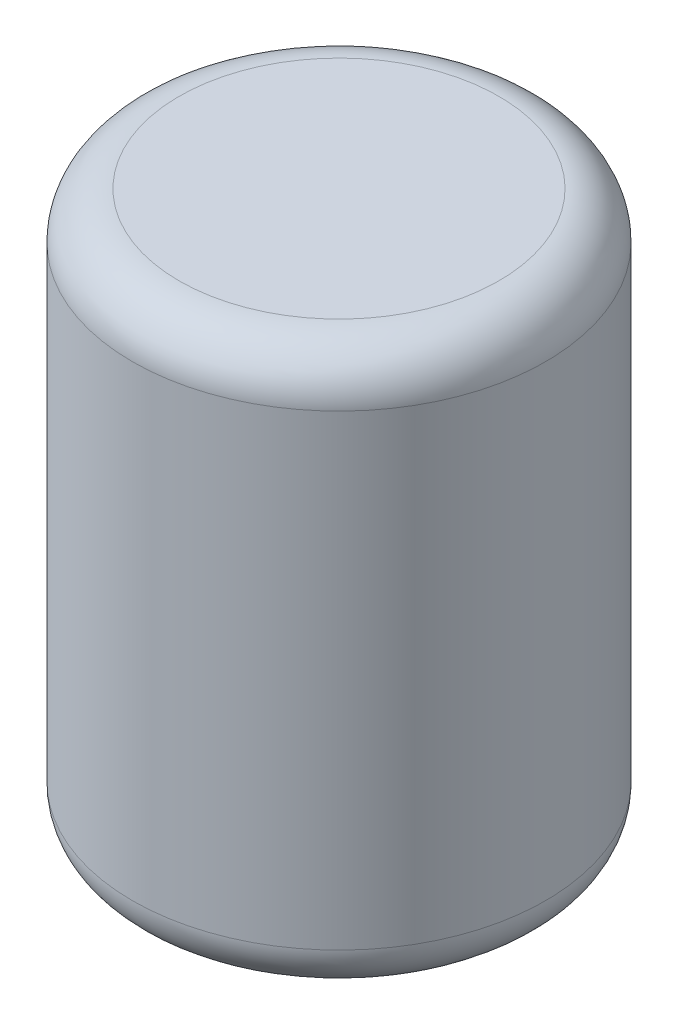
ISO-10303-21;
HEADER;
FILE_DESCRIPTION(('STEP AP214'),'2;1');
FILE_NAME('part.step','',(''),(''),'','','');
FILE_SCHEMA(('AUTOMOTIVE_DESIGN { 1 0 10303 214 1 1 1 1 }'));
ENDSEC;
DATA;
#1=APPLICATION_CONTEXT('core data for automotive mechanical design processes');
#2=APPLICATION_PROTOCOL_DEFINITION('international standard','automotive_design',2000,#1);
#3=PRODUCT_CONTEXT('',#1,'mechanical');
#4=PRODUCT('Part','Part','',(#3));
#5=PRODUCT_RELATED_PRODUCT_CATEGORY('part','',(#4));
#6=PRODUCT_DEFINITION_FORMATION('','',#4);
#7=PRODUCT_DEFINITION_CONTEXT('part definition',#1,'design');
#8=PRODUCT_DEFINITION('design','',#6,#7);
#9=PRODUCT_DEFINITION_SHAPE('','',#8);
#10=(LENGTH_UNIT() NAMED_UNIT(*) SI_UNIT(.MILLI.,.METRE.));
#11=(NAMED_UNIT(*) PLANE_ANGLE_UNIT() SI_UNIT($,.RADIAN.));
#12=(NAMED_UNIT(*) SI_UNIT($,.STERADIAN.) SOLID_ANGLE_UNIT());
#13=UNCERTAINTY_MEASURE_WITH_UNIT(LENGTH_MEASURE(1.E-05),#10,'distance_accuracy_value','');
#14=(GEOMETRIC_REPRESENTATION_CONTEXT(3) GLOBAL_UNCERTAINTY_ASSIGNED_CONTEXT((#13)) GLOBAL_UNIT_ASSIGNED_CONTEXT((#10,
#11,#12)) REPRESENTATION_CONTEXT('',''));
#15=CARTESIAN_POINT('',(0.,0.,0.));
#16=DIRECTION('',(0.,0.,1.));
#17=DIRECTION('',(1.,0.,0.));
#18=AXIS2_PLACEMENT_3D('',#15,#16,#17);
#19=CARTESIAN_POINT('',(0.,120.,0.));
#20=DIRECTION('',(0.,-1.,0.));
#21=DIRECTION('',(0.,0.,-1.));
#22=AXIS2_PLACEMENT_3D('',#19,#20,#21);
#23=CYLINDRICAL_SURFACE('',#22,44.25);
#24=CARTESIAN_POINT('',(0.,110.,0.));
#25=DIRECTION('',(0.,1.,0.));
#26=DIRECTION('',(0.,0.,1.));
#27=AXIS2_PLACEMENT_3D('',#24,#25,#26);
#28=CIRCLE('',#27,44.25);
#29=CARTESIAN_POINT('',(0.,110.,44.25));
#30=VERTEX_POINT('',#29);
#31=EDGE_CURVE('E38',#30,#30,#28,.F.);
#32=ORIENTED_EDGE('',*,*,#31,.T.);
#33=EDGE_LOOP('',(#32));
#34=FACE_BOUND('',#33,.T.);
#35=CARTESIAN_POINT('',(0.,9.99999999999998,0.));
#36=DIRECTION('',(0.,1.,0.));
#37=DIRECTION('',(0.,0.,1.));
#38=AXIS2_PLACEMENT_3D('',#35,#36,#37);
#39=CIRCLE('',#38,44.25);
#40=CARTESIAN_POINT('',(0.,9.99999999999998,44.25));
#41=VERTEX_POINT('',#40);
#42=EDGE_CURVE('E42',#41,#41,#39,.T.);
#43=ORIENTED_EDGE('',*,*,#42,.T.);
#44=EDGE_LOOP('',(#43));
#45=FACE_BOUND('',#44,.T.);
#46=ADVANCED_FACE('F31',(#34,#45),#23,.T.);
#47=CARTESIAN_POINT('',(0.,120.,0.));
#48=DIRECTION('',(0.,1.,0.));
#49=DIRECTION('',(0.,0.,1.));
#50=AXIS2_PLACEMENT_3D('',#47,#48,#49);
#51=PLANE('',#50);
#52=CARTESIAN_POINT('',(0.,120.,0.));
#53=DIRECTION('',(0.,1.,0.));
#54=DIRECTION('',(0.,0.,1.));
#55=AXIS2_PLACEMENT_3D('',#52,#53,#54);
#56=CIRCLE('',#55,34.25);
#57=CARTESIAN_POINT('',(0.,120.,34.25));
#58=VERTEX_POINT('',#57);
#59=EDGE_CURVE('E46',#58,#58,#56,.T.);
#60=ORIENTED_EDGE('',*,*,#59,.T.);
#61=EDGE_LOOP('',(#60));
#62=FACE_BOUND('',#61,.T.);
#63=ADVANCED_FACE('F52',(#62),#51,.T.);
#64=CARTESIAN_POINT('',(0.,0.,0.));
#65=DIRECTION('',(0.,1.,0.));
#66=DIRECTION('',(0.,0.,1.));
#67=AXIS2_PLACEMENT_3D('',#64,#65,#66);
#68=PLANE('',#67);
#69=CARTESIAN_POINT('',(0.,0.,0.));
#70=DIRECTION('',(0.,1.,0.));
#71=DIRECTION('',(0.,0.,1.));
#72=AXIS2_PLACEMENT_3D('',#69,#70,#71);
#73=CIRCLE('',#72,34.25);
#74=CARTESIAN_POINT('',(0.,0.,34.25));
#75=VERTEX_POINT('',#74);
#76=EDGE_CURVE('E10',#75,#75,#73,.F.);
#77=ORIENTED_EDGE('',*,*,#76,.T.);
#78=EDGE_LOOP('',(#77));
#79=FACE_BOUND('',#78,.T.);
#80=ADVANCED_FACE('F56',(#79),#68,.F.);
#81=CARTESIAN_POINT('',(0.,110.,0.));
#82=DIRECTION('',(0.,1.,0.));
#83=DIRECTION('',(0.,0.,1.));
#84=AXIS2_PLACEMENT_3D('',#81,#82,#83);
#85=TOROIDAL_SURFACE('',#84,34.25,10.);
#86=ORIENTED_EDGE('',*,*,#31,.F.);
#87=EDGE_LOOP('',(#86));
#88=FACE_BOUND('',#87,.T.);
#89=ORIENTED_EDGE('',*,*,#59,.F.);
#90=EDGE_LOOP('',(#89));
#91=FACE_BOUND('',#90,.T.);
#92=ADVANCED_FACE('F54',(#88,#91),#85,.T.);
#93=CARTESIAN_POINT('',(0.,9.99999999999999,0.));
#94=DIRECTION('',(0.,1.,0.));
#95=DIRECTION('',(0.,0.,1.));
#96=AXIS2_PLACEMENT_3D('',#93,#94,#95);
#97=TOROIDAL_SURFACE('',#96,34.25,10.);
#98=ORIENTED_EDGE('',*,*,#76,.F.);
#99=EDGE_LOOP('',(#98));
#100=FACE_BOUND('',#99,.T.);
#101=ORIENTED_EDGE('',*,*,#42,.F.);
#102=EDGE_LOOP('',(#101));
#103=FACE_BOUND('',#102,.T.);
#104=ADVANCED_FACE('F33',(#100,#103),#97,.T.);
#105=CLOSED_SHELL('',(#46,#63,#80,#92,#104));
#106=MANIFOLD_SOLID_BREP('B2',#105);
#107=ADVANCED_BREP_SHAPE_REPRESENTATION('',(#18,#106),#14);
#108=SHAPE_DEFINITION_REPRESENTATION(#9,#107);
ENDSEC;
END-ISO-10303-21;
